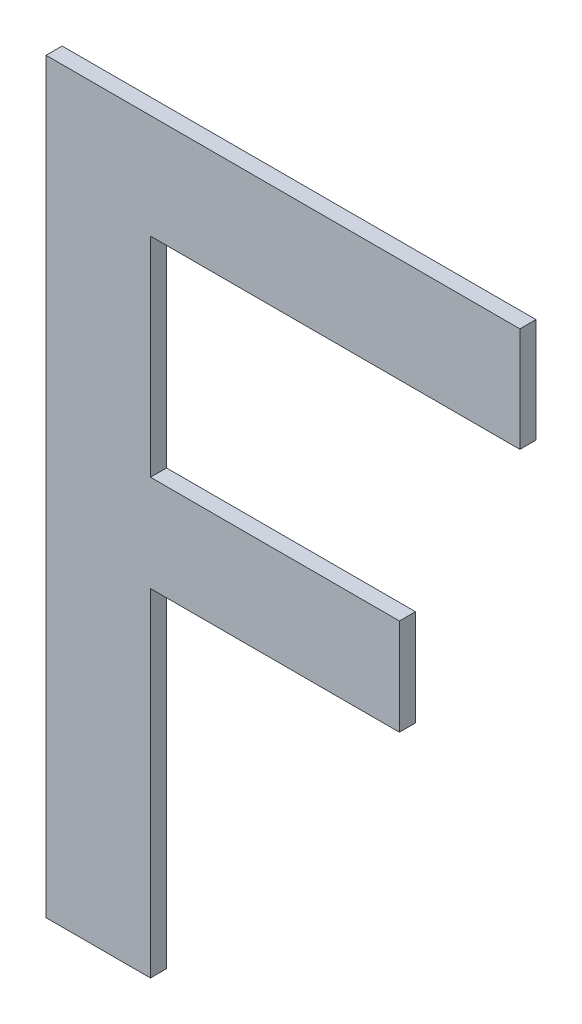
ISO-10303-21;
HEADER;
FILE_DESCRIPTION(('STEP AP214'),'2;1');
FILE_NAME('part.step','',(''),(''),'','','');
FILE_SCHEMA(('AUTOMOTIVE_DESIGN { 1 0 10303 214 1 1 1 1 }'));
ENDSEC;
DATA;
#1=APPLICATION_CONTEXT('core data for automotive mechanical design processes');
#2=APPLICATION_PROTOCOL_DEFINITION('international standard','automotive_design',2000,#1);
#3=PRODUCT_CONTEXT('',#1,'mechanical');
#4=PRODUCT('Part','Part','',(#3));
#5=PRODUCT_RELATED_PRODUCT_CATEGORY('part','',(#4));
#6=PRODUCT_DEFINITION_FORMATION('','',#4);
#7=PRODUCT_DEFINITION_CONTEXT('part definition',#1,'design');
#8=PRODUCT_DEFINITION('design','',#6,#7);
#9=PRODUCT_DEFINITION_SHAPE('','',#8);
#10=(LENGTH_UNIT() NAMED_UNIT(*) SI_UNIT(.MILLI.,.METRE.));
#11=(NAMED_UNIT(*) PLANE_ANGLE_UNIT() SI_UNIT($,.RADIAN.));
#12=(NAMED_UNIT(*) SI_UNIT($,.STERADIAN.) SOLID_ANGLE_UNIT());
#13=UNCERTAINTY_MEASURE_WITH_UNIT(LENGTH_MEASURE(1.E-05),#10,'distance_accuracy_value','');
#14=(GEOMETRIC_REPRESENTATION_CONTEXT(3) GLOBAL_UNCERTAINTY_ASSIGNED_CONTEXT((#13)) GLOBAL_UNIT_ASSIGNED_CONTEXT((#10,
#11,#12)) REPRESENTATION_CONTEXT('',''));
#15=CARTESIAN_POINT('',(0.,0.,0.));
#16=DIRECTION('',(0.,0.,1.));
#17=DIRECTION('',(1.,0.,0.));
#18=AXIS2_PLACEMENT_3D('',#15,#16,#17);
#19=CARTESIAN_POINT('',(-0.29500068,-0.4649978,0.));
#20=DIRECTION('',(0.,0.,1.));
#21=DIRECTION('',(1.,0.,0.));
#22=AXIS2_PLACEMENT_3D('',#19,#20,#21);
#23=PLANE('',#22);
#24=DIRECTION('',(-1.,0.,0.));
#25=VECTOR('',#24,1.);
#26=CARTESIAN_POINT('',(-0.29500068,0.46500034,0.));
#27=LINE('',#26,#25);
#28=CARTESIAN_POINT('',(0.29500068,0.46500034,0.));
#29=VERTEX_POINT('',#28);
#30=CARTESIAN_POINT('',(-0.29500068,0.46500034,0.));
#31=VERTEX_POINT('',#30);
#32=EDGE_CURVE('E46',#29,#31,#27,.T.);
#33=ORIENTED_EDGE('',*,*,#32,.F.);
#34=DIRECTION('',(0.,1.,0.));
#35=VECTOR('',#34,1.);
#36=CARTESIAN_POINT('',(0.29500068,-0.4649978,0.));
#37=LINE('',#36,#35);
#38=CARTESIAN_POINT('',(0.29500068,0.3350006,0.));
#39=VERTEX_POINT('',#38);
#40=EDGE_CURVE('E130',#39,#29,#37,.T.);
#41=ORIENTED_EDGE('',*,*,#40,.F.);
#42=DIRECTION('',(1.,0.,0.));
#43=VECTOR('',#42,1.);
#44=CARTESIAN_POINT('',(-0.29500068,0.3350006,0.));
#45=LINE('',#44,#43);
#46=CARTESIAN_POINT('',(-0.16500094,0.3350006,0.));
#47=VERTEX_POINT('',#46);
#48=EDGE_CURVE('E87',#47,#39,#45,.T.);
#49=ORIENTED_EDGE('',*,*,#48,.F.);
#50=DIRECTION('',(0.,1.,0.));
#51=VECTOR('',#50,1.);
#52=CARTESIAN_POINT('',(-0.16500094,-0.4649978,0.));
#53=LINE('',#52,#51);
#54=CARTESIAN_POINT('',(-0.16500094,0.07500112,0.));
#55=VERTEX_POINT('',#54);
#56=EDGE_CURVE('E79',#55,#47,#53,.T.);
#57=ORIENTED_EDGE('',*,*,#56,.F.);
#58=DIRECTION('',(-1.,0.,0.));
#59=VECTOR('',#58,1.);
#60=CARTESIAN_POINT('',(-0.29500068,0.07500112,0.));
#61=LINE('',#60,#59);
#62=CARTESIAN_POINT('',(0.14500098,0.07500112,0.));
#63=VERTEX_POINT('',#62);
#64=EDGE_CURVE('E187',#63,#55,#61,.T.);
#65=ORIENTED_EDGE('',*,*,#64,.F.);
#66=DIRECTION('',(0.,1.,0.));
#67=VECTOR('',#66,1.);
#68=CARTESIAN_POINT('',(0.14500098,-0.4649978,0.));
#69=LINE('',#68,#67);
#70=CARTESIAN_POINT('',(0.14500098,-0.04499864,0.));
#71=VERTEX_POINT('',#70);
#72=EDGE_CURVE('E182',#71,#63,#69,.T.);
#73=ORIENTED_EDGE('',*,*,#72,.F.);
#74=DIRECTION('',(1.,0.,0.));
#75=VECTOR('',#74,1.);
#76=CARTESIAN_POINT('',(-0.29500068,-0.04499864,0.));
#77=LINE('',#76,#75);
#78=CARTESIAN_POINT('',(-0.16500094,-0.04499864,0.));
#79=VERTEX_POINT('',#78);
#80=EDGE_CURVE('E171',#79,#71,#77,.T.);
#81=ORIENTED_EDGE('',*,*,#80,.F.);
#82=DIRECTION('',(0.,1.,0.));
#83=VECTOR('',#82,1.);
#84=CARTESIAN_POINT('',(-0.16500094,-0.4649978,0.));
#85=LINE('',#84,#83);
#86=CARTESIAN_POINT('',(-0.16500094,-0.4649978,0.));
#87=VERTEX_POINT('',#86);
#88=EDGE_CURVE('E166',#87,#79,#85,.T.);
#89=ORIENTED_EDGE('',*,*,#88,.F.);
#90=DIRECTION('',(1.,0.,0.));
#91=VECTOR('',#90,1.);
#92=CARTESIAN_POINT('',(-0.29500068,-0.4649978,0.));
#93=LINE('',#92,#91);
#94=CARTESIAN_POINT('',(-0.29500068,-0.4649978,0.));
#95=VERTEX_POINT('',#94);
#96=EDGE_CURVE('E158',#95,#87,#93,.T.);
#97=ORIENTED_EDGE('',*,*,#96,.F.);
#98=DIRECTION('',(0.,-1.,0.));
#99=VECTOR('',#98,1.);
#100=CARTESIAN_POINT('',(-0.29500068,-0.4649978,0.));
#101=LINE('',#100,#99);
#102=EDGE_CURVE('E11',#31,#95,#101,.T.);
#103=ORIENTED_EDGE('',*,*,#102,.F.);
#104=EDGE_LOOP('',(#33,#41,#49,#57,#65,#73,#81,#89,#97,#103));
#105=FACE_BOUND('',#104,.T.);
#106=ADVANCED_FACE('F17',(#105),#23,.F.);
#107=CARTESIAN_POINT('',(-0.29500068,-0.4649978,0.));
#108=DIRECTION('',(-1.,0.,0.));
#109=DIRECTION('',(0.,0.,1.));
#110=AXIS2_PLACEMENT_3D('',#107,#108,#109);
#111=PLANE('',#110);
#112=DIRECTION('',(0.,0.,-1.));
#113=VECTOR('',#112,1.);
#114=CARTESIAN_POINT('',(-0.29500068,0.46500034,0.));
#115=LINE('',#114,#113);
#116=CARTESIAN_POINT('',(-0.29500068,0.46500034,0.02));
#117=VERTEX_POINT('',#116);
#118=EDGE_CURVE('E26',#117,#31,#115,.T.);
#119=ORIENTED_EDGE('',*,*,#118,.T.);
#120=ORIENTED_EDGE('',*,*,#102,.T.);
#121=DIRECTION('',(0.,0.,1.));
#122=VECTOR('',#121,1.);
#123=CARTESIAN_POINT('',(-0.29500068,-0.4649978,0.));
#124=LINE('',#123,#122);
#125=CARTESIAN_POINT('',(-0.29500068,-0.4649978,0.02));
#126=VERTEX_POINT('',#125);
#127=EDGE_CURVE('E140',#95,#126,#124,.T.);
#128=ORIENTED_EDGE('',*,*,#127,.T.);
#129=DIRECTION('',(0.,1.,0.));
#130=VECTOR('',#129,1.);
#131=CARTESIAN_POINT('',(-0.29500068,-0.4649978,0.02));
#132=LINE('',#131,#130);
#133=EDGE_CURVE('E209',#126,#117,#132,.T.);
#134=ORIENTED_EDGE('',*,*,#133,.T.);
#135=EDGE_LOOP('',(#119,#120,#128,#134));
#136=FACE_BOUND('',#135,.T.);
#137=ADVANCED_FACE('F19',(#136),#111,.T.);
#138=CARTESIAN_POINT('',(-0.29500068,0.46500034,0.));
#139=DIRECTION('',(0.,1.,0.));
#140=DIRECTION('',(1.,0.,0.));
#141=AXIS2_PLACEMENT_3D('',#138,#139,#140);
#142=PLANE('',#141);
#143=DIRECTION('',(0.,0.,-1.));
#144=VECTOR('',#143,1.);
#145=CARTESIAN_POINT('',(0.29500068,0.46500034,0.));
#146=LINE('',#145,#144);
#147=CARTESIAN_POINT('',(0.29500068,0.46500034,0.02));
#148=VERTEX_POINT('',#147);
#149=EDGE_CURVE('E135',#148,#29,#146,.T.);
#150=ORIENTED_EDGE('',*,*,#149,.T.);
#151=ORIENTED_EDGE('',*,*,#32,.T.);
#152=ORIENTED_EDGE('',*,*,#118,.F.);
#153=DIRECTION('',(1.,0.,0.));
#154=VECTOR('',#153,1.);
#155=CARTESIAN_POINT('',(-0.29500068,0.46500034,0.02));
#156=LINE('',#155,#154);
#157=EDGE_CURVE('E212',#117,#148,#156,.T.);
#158=ORIENTED_EDGE('',*,*,#157,.T.);
#159=EDGE_LOOP('',(#150,#151,#152,#158));
#160=FACE_BOUND('',#159,.T.);
#161=ADVANCED_FACE('F211',(#160),#142,.T.);
#162=CARTESIAN_POINT('',(0.29500068,0.46500034,0.));
#163=DIRECTION('',(1.,0.,0.));
#164=DIRECTION('',(0.,1.,0.));
#165=AXIS2_PLACEMENT_3D('',#162,#163,#164);
#166=PLANE('',#165);
#167=DIRECTION('',(0.,0.,-1.));
#168=VECTOR('',#167,1.);
#169=CARTESIAN_POINT('',(0.29500068,0.3350006,0.));
#170=LINE('',#169,#168);
#171=CARTESIAN_POINT('',(0.29500068,0.3350006,0.02));
#172=VERTEX_POINT('',#171);
#173=EDGE_CURVE('E121',#172,#39,#170,.T.);
#174=ORIENTED_EDGE('',*,*,#173,.T.);
#175=ORIENTED_EDGE('',*,*,#40,.T.);
#176=ORIENTED_EDGE('',*,*,#149,.F.);
#177=DIRECTION('',(0.,-1.,0.));
#178=VECTOR('',#177,1.);
#179=CARTESIAN_POINT('',(0.29500068,0.46500034,0.02));
#180=LINE('',#179,#178);
#181=EDGE_CURVE('E133',#148,#172,#180,.T.);
#182=ORIENTED_EDGE('',*,*,#181,.T.);
#183=EDGE_LOOP('',(#174,#175,#176,#182));
#184=FACE_BOUND('',#183,.T.);
#185=ADVANCED_FACE('F134',(#184),#166,.T.);
#186=CARTESIAN_POINT('',(0.29500068,0.3350006,0.));
#187=DIRECTION('',(0.,-1.,0.));
#188=DIRECTION('',(0.,0.,-1.));
#189=AXIS2_PLACEMENT_3D('',#186,#187,#188);
#190=PLANE('',#189);
#191=DIRECTION('',(0.,0.,-1.));
#192=VECTOR('',#191,1.);
#193=CARTESIAN_POINT('',(-0.16500094,0.3350006,0.));
#194=LINE('',#193,#192);
#195=CARTESIAN_POINT('',(-0.16500094,0.3350006,0.02));
#196=VERTEX_POINT('',#195);
#197=EDGE_CURVE('E196',#196,#47,#194,.T.);
#198=ORIENTED_EDGE('',*,*,#197,.T.);
#199=ORIENTED_EDGE('',*,*,#48,.T.);
#200=ORIENTED_EDGE('',*,*,#173,.F.);
#201=DIRECTION('',(-1.,0.,0.));
#202=VECTOR('',#201,1.);
#203=CARTESIAN_POINT('',(0.29500068,0.3350006,0.02));
#204=LINE('',#203,#202);
#205=EDGE_CURVE('E125',#172,#196,#204,.T.);
#206=ORIENTED_EDGE('',*,*,#205,.T.);
#207=EDGE_LOOP('',(#198,#199,#200,#206));
#208=FACE_BOUND('',#207,.T.);
#209=ADVANCED_FACE('F123',(#208),#190,.T.);
#210=CARTESIAN_POINT('',(-0.16500094,0.3350006,0.));
#211=DIRECTION('',(1.,0.,0.));
#212=DIRECTION('',(0.,1.,0.));
#213=AXIS2_PLACEMENT_3D('',#210,#211,#212);
#214=PLANE('',#213);
#215=DIRECTION('',(0.,0.,-1.));
#216=VECTOR('',#215,1.);
#217=CARTESIAN_POINT('',(-0.16500094,0.07500112,0.));
#218=LINE('',#217,#216);
#219=CARTESIAN_POINT('',(-0.16500094,0.07500112,0.02));
#220=VERTEX_POINT('',#219);
#221=EDGE_CURVE('E191',#220,#55,#218,.T.);
#222=ORIENTED_EDGE('',*,*,#221,.T.);
#223=ORIENTED_EDGE('',*,*,#56,.T.);
#224=ORIENTED_EDGE('',*,*,#197,.F.);
#225=DIRECTION('',(0.,-1.,0.));
#226=VECTOR('',#225,1.);
#227=CARTESIAN_POINT('',(-0.16500094,0.3350006,0.02));
#228=LINE('',#227,#226);
#229=EDGE_CURVE('E145',#196,#220,#228,.T.);
#230=ORIENTED_EDGE('',*,*,#229,.T.);
#231=EDGE_LOOP('',(#222,#223,#224,#230));
#232=FACE_BOUND('',#231,.T.);
#233=ADVANCED_FACE('F356',(#232),#214,.T.);
#234=CARTESIAN_POINT('',(-0.16500094,0.07500112,0.));
#235=DIRECTION('',(0.,1.,0.));
#236=DIRECTION('',(1.,0.,0.));
#237=AXIS2_PLACEMENT_3D('',#234,#235,#236);
#238=PLANE('',#237);
#239=DIRECTION('',(0.,0.,-1.));
#240=VECTOR('',#239,1.);
#241=CARTESIAN_POINT('',(0.14500098,0.07500112,0.));
#242=LINE('',#241,#240);
#243=CARTESIAN_POINT('',(0.14500098,0.07500112,0.02));
#244=VERTEX_POINT('',#243);
#245=EDGE_CURVE('E183',#244,#63,#242,.T.);
#246=ORIENTED_EDGE('',*,*,#245,.T.);
#247=ORIENTED_EDGE('',*,*,#64,.T.);
#248=ORIENTED_EDGE('',*,*,#221,.F.);
#249=DIRECTION('',(1.,0.,0.));
#250=VECTOR('',#249,1.);
#251=CARTESIAN_POINT('',(-0.16500094,0.07500112,0.02));
#252=LINE('',#251,#250);
#253=EDGE_CURVE('E152',#220,#244,#252,.T.);
#254=ORIENTED_EDGE('',*,*,#253,.T.);
#255=EDGE_LOOP('',(#246,#247,#248,#254));
#256=FACE_BOUND('',#255,.T.);
#257=ADVANCED_FACE('F350',(#256),#238,.T.);
#258=CARTESIAN_POINT('',(0.14500098,0.07500112,0.));
#259=DIRECTION('',(1.,0.,0.));
#260=DIRECTION('',(0.,1.,0.));
#261=AXIS2_PLACEMENT_3D('',#258,#259,#260);
#262=PLANE('',#261);
#263=DIRECTION('',(0.,0.,-1.));
#264=VECTOR('',#263,1.);
#265=CARTESIAN_POINT('',(0.14500098,-0.04499864,0.));
#266=LINE('',#265,#264);
#267=CARTESIAN_POINT('',(0.14500098,-0.04499864,0.02));
#268=VERTEX_POINT('',#267);
#269=EDGE_CURVE('E175',#268,#71,#266,.T.);
#270=ORIENTED_EDGE('',*,*,#269,.T.);
#271=ORIENTED_EDGE('',*,*,#72,.T.);
#272=ORIENTED_EDGE('',*,*,#245,.F.);
#273=DIRECTION('',(0.,-1.,0.));
#274=VECTOR('',#273,1.);
#275=CARTESIAN_POINT('',(0.14500098,0.07500112,0.02));
#276=LINE('',#275,#274);
#277=EDGE_CURVE('E220',#244,#268,#276,.T.);
#278=ORIENTED_EDGE('',*,*,#277,.T.);
#279=EDGE_LOOP('',(#270,#271,#272,#278));
#280=FACE_BOUND('',#279,.T.);
#281=ADVANCED_FACE('F355',(#280),#262,.T.);
#282=CARTESIAN_POINT('',(0.14500098,-0.04499864,0.));
#283=DIRECTION('',(0.,-1.,0.));
#284=DIRECTION('',(0.,0.,-1.));
#285=AXIS2_PLACEMENT_3D('',#282,#283,#284);
#286=PLANE('',#285);
#287=DIRECTION('',(0.,0.,-1.));
#288=VECTOR('',#287,1.);
#289=CARTESIAN_POINT('',(-0.16500094,-0.04499864,0.));
#290=LINE('',#289,#288);
#291=CARTESIAN_POINT('',(-0.16500094,-0.04499864,0.02));
#292=VERTEX_POINT('',#291);
#293=EDGE_CURVE('E169',#292,#79,#290,.T.);
#294=ORIENTED_EDGE('',*,*,#293,.T.);
#295=ORIENTED_EDGE('',*,*,#80,.T.);
#296=ORIENTED_EDGE('',*,*,#269,.F.);
#297=DIRECTION('',(-1.,0.,0.));
#298=VECTOR('',#297,1.);
#299=CARTESIAN_POINT('',(0.14500098,-0.04499864,0.02));
#300=LINE('',#299,#298);
#301=EDGE_CURVE('E224',#268,#292,#300,.T.);
#302=ORIENTED_EDGE('',*,*,#301,.T.);
#303=EDGE_LOOP('',(#294,#295,#296,#302));
#304=FACE_BOUND('',#303,.T.);
#305=ADVANCED_FACE('F366',(#304),#286,.T.);
#306=CARTESIAN_POINT('',(-0.16500094,-0.04499864,0.));
#307=DIRECTION('',(1.,0.,0.));
#308=DIRECTION('',(0.,1.,0.));
#309=AXIS2_PLACEMENT_3D('',#306,#307,#308);
#310=PLANE('',#309);
#311=DIRECTION('',(0.,0.,-1.));
#312=VECTOR('',#311,1.);
#313=CARTESIAN_POINT('',(-0.16500094,-0.4649978,0.));
#314=LINE('',#313,#312);
#315=CARTESIAN_POINT('',(-0.16500094,-0.4649978,0.02));
#316=VERTEX_POINT('',#315);
#317=EDGE_CURVE('E162',#316,#87,#314,.T.);
#318=ORIENTED_EDGE('',*,*,#317,.T.);
#319=ORIENTED_EDGE('',*,*,#88,.T.);
#320=ORIENTED_EDGE('',*,*,#293,.F.);
#321=DIRECTION('',(0.,-1.,0.));
#322=VECTOR('',#321,1.);
#323=CARTESIAN_POINT('',(-0.16500094,-0.04499864,0.02));
#324=LINE('',#323,#322);
#325=EDGE_CURVE('E228',#292,#316,#324,.T.);
#326=ORIENTED_EDGE('',*,*,#325,.T.);
#327=EDGE_LOOP('',(#318,#319,#320,#326));
#328=FACE_BOUND('',#327,.T.);
#329=ADVANCED_FACE('F344',(#328),#310,.T.);
#330=CARTESIAN_POINT('',(-0.16500094,-0.4649978,0.));
#331=DIRECTION('',(0.,-1.,0.));
#332=DIRECTION('',(0.,0.,-1.));
#333=AXIS2_PLACEMENT_3D('',#330,#331,#332);
#334=PLANE('',#333);
#335=ORIENTED_EDGE('',*,*,#127,.F.);
#336=ORIENTED_EDGE('',*,*,#96,.T.);
#337=ORIENTED_EDGE('',*,*,#317,.F.);
#338=DIRECTION('',(-1.,0.,0.));
#339=VECTOR('',#338,1.);
#340=CARTESIAN_POINT('',(-0.16500094,-0.4649978,0.02));
#341=LINE('',#340,#339);
#342=EDGE_CURVE('E229',#316,#126,#341,.T.);
#343=ORIENTED_EDGE('',*,*,#342,.T.);
#344=EDGE_LOOP('',(#335,#336,#337,#343));
#345=FACE_BOUND('',#344,.T.);
#346=ADVANCED_FACE('F336',(#345),#334,.T.);
#347=CARTESIAN_POINT('',(-0.29500068,-0.4649978,0.02));
#348=DIRECTION('',(0.,0.,1.));
#349=DIRECTION('',(1.,0.,0.));
#350=AXIS2_PLACEMENT_3D('',#347,#348,#349);
#351=PLANE('',#350);
#352=ORIENTED_EDGE('',*,*,#157,.F.);
#353=ORIENTED_EDGE('',*,*,#133,.F.);
#354=ORIENTED_EDGE('',*,*,#342,.F.);
#355=ORIENTED_EDGE('',*,*,#325,.F.);
#356=ORIENTED_EDGE('',*,*,#301,.F.);
#357=ORIENTED_EDGE('',*,*,#277,.F.);
#358=ORIENTED_EDGE('',*,*,#253,.F.);
#359=ORIENTED_EDGE('',*,*,#229,.F.);
#360=ORIENTED_EDGE('',*,*,#205,.F.);
#361=ORIENTED_EDGE('',*,*,#181,.F.);
#362=EDGE_LOOP('',(#352,#353,#354,#355,#356,#357,#358,#359,#360,#361));
#363=FACE_BOUND('',#362,.T.);
#364=ADVANCED_FACE('F142',(#363),#351,.T.);
#365=CLOSED_SHELL('',(#106,#137,#161,#185,#209,#233,#257,#281,#305,#329,#346,#364));
#366=MANIFOLD_SOLID_BREP('B1',#365);
#367=ADVANCED_BREP_SHAPE_REPRESENTATION('',(#18,#366),#14);
#368=SHAPE_DEFINITION_REPRESENTATION(#9,#367);
ENDSEC;
END-ISO-10303-21;
